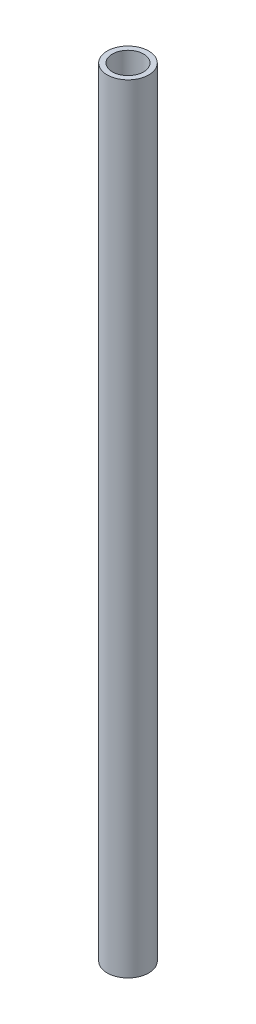
ISO-10303-21;
HEADER;
FILE_DESCRIPTION(('STEP AP214'),'2;1');
FILE_NAME('part.step','',(''),(''),'','','');
FILE_SCHEMA(('AUTOMOTIVE_DESIGN { 1 0 10303 214 1 1 1 1 }'));
ENDSEC;
DATA;
#1=APPLICATION_CONTEXT('core data for automotive mechanical design processes');
#2=APPLICATION_PROTOCOL_DEFINITION('international standard','automotive_design',2000,#1);
#3=PRODUCT_CONTEXT('',#1,'mechanical');
#4=PRODUCT('Part','Part','',(#3));
#5=PRODUCT_RELATED_PRODUCT_CATEGORY('part','',(#4));
#6=PRODUCT_DEFINITION_FORMATION('','',#4);
#7=PRODUCT_DEFINITION_CONTEXT('part definition',#1,'design');
#8=PRODUCT_DEFINITION('design','',#6,#7);
#9=PRODUCT_DEFINITION_SHAPE('','',#8);
#10=(LENGTH_UNIT() NAMED_UNIT(*) SI_UNIT(.MILLI.,.METRE.));
#11=(NAMED_UNIT(*) PLANE_ANGLE_UNIT() SI_UNIT($,.RADIAN.));
#12=(NAMED_UNIT(*) SI_UNIT($,.STERADIAN.) SOLID_ANGLE_UNIT());
#13=UNCERTAINTY_MEASURE_WITH_UNIT(LENGTH_MEASURE(1.E-05),#10,'distance_accuracy_value','');
#14=(GEOMETRIC_REPRESENTATION_CONTEXT(3) GLOBAL_UNCERTAINTY_ASSIGNED_CONTEXT((#13)) GLOBAL_UNIT_ASSIGNED_CONTEXT((#10,
#11,#12)) REPRESENTATION_CONTEXT('',''));
#15=CARTESIAN_POINT('',(0.,0.,0.));
#16=DIRECTION('',(0.,0.,1.));
#17=DIRECTION('',(1.,0.,0.));
#18=AXIS2_PLACEMENT_3D('',#15,#16,#17);
#19=CARTESIAN_POINT('',(0.,300.,0.));
#20=DIRECTION('',(0.,1.,0.));
#21=DIRECTION('',(0.,0.,1.));
#22=AXIS2_PLACEMENT_3D('',#19,#20,#21);
#23=PLANE('',#22);
#24=CARTESIAN_POINT('',(0.,300.,0.));
#25=DIRECTION('',(0.,1.,0.));
#26=DIRECTION('',(0.,0.,1.));
#27=AXIS2_PLACEMENT_3D('',#24,#25,#26);
#28=CIRCLE('',#27,8.);
#29=CARTESIAN_POINT('',(0.,300.,8.));
#30=VERTEX_POINT('',#29);
#31=EDGE_CURVE('E12',#30,#30,#28,.T.);
#32=ORIENTED_EDGE('',*,*,#31,.T.);
#33=EDGE_LOOP('',(#32));
#34=FACE_BOUND('',#33,.T.);
#35=CARTESIAN_POINT('',(0.,300.,0.));
#36=DIRECTION('',(0.,1.,0.));
#37=DIRECTION('',(0.,0.,1.));
#38=AXIS2_PLACEMENT_3D('',#35,#36,#37);
#39=CIRCLE('',#38,6.);
#40=CARTESIAN_POINT('',(0.,300.,6.));
#41=VERTEX_POINT('',#40);
#42=EDGE_CURVE('E60',#41,#41,#39,.T.);
#43=ORIENTED_EDGE('',*,*,#42,.F.);
#44=EDGE_LOOP('',(#43));
#45=FACE_BOUND('',#44,.T.);
#46=ADVANCED_FACE('F47',(#34,#45),#23,.T.);
#47=CARTESIAN_POINT('',(0.,0.,0.));
#48=DIRECTION('',(0.,1.,0.));
#49=DIRECTION('',(0.,0.,1.));
#50=AXIS2_PLACEMENT_3D('',#47,#48,#49);
#51=PLANE('',#50);
#52=CARTESIAN_POINT('',(0.,0.,0.));
#53=DIRECTION('',(0.,1.,0.));
#54=DIRECTION('',(0.,0.,1.));
#55=AXIS2_PLACEMENT_3D('',#52,#53,#54);
#56=CIRCLE('',#55,8.);
#57=CARTESIAN_POINT('',(0.,0.,8.));
#58=VERTEX_POINT('',#57);
#59=EDGE_CURVE('E51',#58,#58,#56,.T.);
#60=ORIENTED_EDGE('',*,*,#59,.F.);
#61=EDGE_LOOP('',(#60));
#62=FACE_BOUND('',#61,.T.);
#63=CARTESIAN_POINT('',(0.,0.,0.));
#64=DIRECTION('',(0.,1.,0.));
#65=DIRECTION('',(0.,0.,1.));
#66=AXIS2_PLACEMENT_3D('',#63,#64,#65);
#67=CIRCLE('',#66,6.);
#68=CARTESIAN_POINT('',(0.,0.,6.));
#69=VERTEX_POINT('',#68);
#70=EDGE_CURVE('E62',#69,#69,#67,.T.);
#71=ORIENTED_EDGE('',*,*,#70,.T.);
#72=EDGE_LOOP('',(#71));
#73=FACE_BOUND('',#72,.T.);
#74=ADVANCED_FACE('F74',(#62,#73),#51,.F.);
#75=CARTESIAN_POINT('',(0.,300.,0.));
#76=DIRECTION('',(0.,-1.,0.));
#77=DIRECTION('',(0.,0.,-1.));
#78=AXIS2_PLACEMENT_3D('',#75,#76,#77);
#79=CYLINDRICAL_SURFACE('',#78,8.);
#80=ORIENTED_EDGE('',*,*,#31,.F.);
#81=EDGE_LOOP('',(#80));
#82=FACE_BOUND('',#81,.T.);
#83=ORIENTED_EDGE('',*,*,#59,.T.);
#84=EDGE_LOOP('',(#83));
#85=FACE_BOUND('',#84,.T.);
#86=ADVANCED_FACE('F49',(#82,#85),#79,.T.);
#87=CARTESIAN_POINT('',(0.,300.,0.));
#88=DIRECTION('',(0.,-1.,0.));
#89=DIRECTION('',(0.,0.,-1.));
#90=AXIS2_PLACEMENT_3D('',#87,#88,#89);
#91=CYLINDRICAL_SURFACE('',#90,6.);
#92=ORIENTED_EDGE('',*,*,#42,.T.);
#93=EDGE_LOOP('',(#92));
#94=FACE_BOUND('',#93,.T.);
#95=ORIENTED_EDGE('',*,*,#70,.F.);
#96=EDGE_LOOP('',(#95));
#97=FACE_BOUND('',#96,.T.);
#98=ADVANCED_FACE('F70',(#94,#97),#91,.F.);
#99=CLOSED_SHELL('',(#46,#74,#86,#98));
#100=MANIFOLD_SOLID_BREP('B2',#99);
#101=ADVANCED_BREP_SHAPE_REPRESENTATION('',(#18,#100),#14);
#102=SHAPE_DEFINITION_REPRESENTATION(#9,#101);
ENDSEC;
END-ISO-10303-21;
